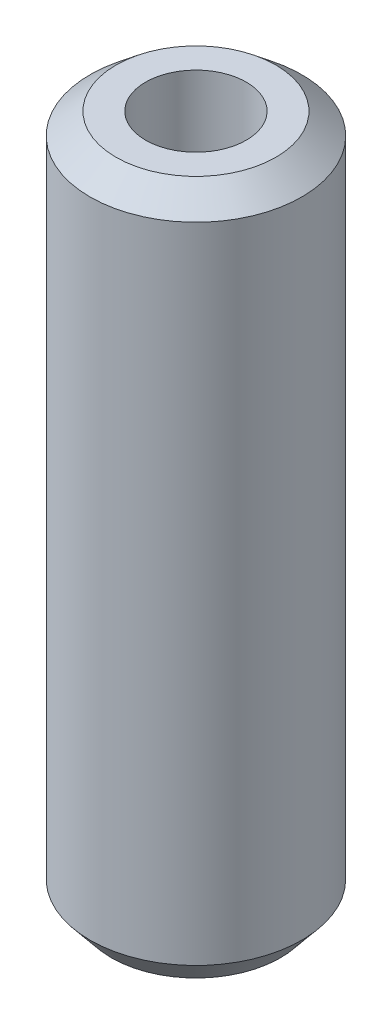
ISO-10303-21;
HEADER;
FILE_DESCRIPTION(('STEP AP214'),'2;1');
FILE_NAME('part.step','',(''),(''),'','','');
FILE_SCHEMA(('AUTOMOTIVE_DESIGN { 1 0 10303 214 1 1 1 1 }'));
ENDSEC;
DATA;
#1=APPLICATION_CONTEXT('core data for automotive mechanical design processes');
#2=APPLICATION_PROTOCOL_DEFINITION('international standard','automotive_design',2000,#1);
#3=PRODUCT_CONTEXT('',#1,'mechanical');
#4=PRODUCT('Part','Part','',(#3));
#5=PRODUCT_RELATED_PRODUCT_CATEGORY('part','',(#4));
#6=PRODUCT_DEFINITION_FORMATION('','',#4);
#7=PRODUCT_DEFINITION_CONTEXT('part definition',#1,'design');
#8=PRODUCT_DEFINITION('design','',#6,#7);
#9=PRODUCT_DEFINITION_SHAPE('','',#8);
#10=(LENGTH_UNIT() NAMED_UNIT(*) SI_UNIT(.MILLI.,.METRE.));
#11=(NAMED_UNIT(*) PLANE_ANGLE_UNIT() SI_UNIT($,.RADIAN.));
#12=(NAMED_UNIT(*) SI_UNIT($,.STERADIAN.) SOLID_ANGLE_UNIT());
#13=UNCERTAINTY_MEASURE_WITH_UNIT(LENGTH_MEASURE(1.E-05),#10,'distance_accuracy_value','');
#14=(GEOMETRIC_REPRESENTATION_CONTEXT(3) GLOBAL_UNCERTAINTY_ASSIGNED_CONTEXT((#13)) GLOBAL_UNIT_ASSIGNED_CONTEXT((#10,
#11,#12)) REPRESENTATION_CONTEXT('',''));
#15=CARTESIAN_POINT('',(0.,0.,0.));
#16=DIRECTION('',(0.,0.,1.));
#17=DIRECTION('',(1.,0.,0.));
#18=AXIS2_PLACEMENT_3D('',#15,#16,#17);
#19=CARTESIAN_POINT('',(0.,146.788859648604,0.));
#20=DIRECTION('',(0.,-1.,0.));
#21=DIRECTION('',(0.,0.,-1.));
#22=AXIS2_PLACEMENT_3D('',#19,#20,#21);
#23=CYLINDRICAL_SURFACE('',#22,22.5);
#24=CARTESIAN_POINT('',(0.,142.253385884476,0.));
#25=DIRECTION('',(0.,1.,0.));
#26=DIRECTION('',(0.,0.,1.));
#27=AXIS2_PLACEMENT_3D('',#24,#25,#26);
#28=CIRCLE('',#27,22.5);
#29=CARTESIAN_POINT('',(0.,142.253385884476,22.5));
#30=VERTEX_POINT('',#29);
#31=EDGE_CURVE('E50',#30,#30,#28,.F.);
#32=ORIENTED_EDGE('',*,*,#31,.T.);
#33=EDGE_LOOP('',(#32));
#34=FACE_BOUND('',#33,.T.);
#35=CARTESIAN_POINT('',(0.,5.51841156021457,0.));
#36=DIRECTION('',(0.,1.,0.));
#37=DIRECTION('',(0.,0.,1.));
#38=AXIS2_PLACEMENT_3D('',#35,#36,#37);
#39=CIRCLE('',#38,22.5);
#40=CARTESIAN_POINT('',(0.,5.51841156021457,22.5));
#41=VERTEX_POINT('',#40);
#42=EDGE_CURVE('E51',#41,#41,#39,.T.);
#43=ORIENTED_EDGE('',*,*,#42,.T.);
#44=EDGE_LOOP('',(#43));
#45=FACE_BOUND('',#44,.T.);
#46=ADVANCED_FACE('F39',(#34,#45),#23,.T.);
#47=CARTESIAN_POINT('',(0.,146.788859648604,0.));
#48=DIRECTION('',(0.,1.,0.));
#49=DIRECTION('',(0.,0.,1.));
#50=AXIS2_PLACEMENT_3D('',#47,#48,#49);
#51=PLANE('',#50);
#52=CARTESIAN_POINT('',(0.,146.788859648604,0.));
#53=DIRECTION('',(0.,1.,0.));
#54=DIRECTION('',(0.,0.,1.));
#55=AXIS2_PLACEMENT_3D('',#52,#53,#54);
#56=CIRCLE('',#55,16.9815884397855);
#57=CARTESIAN_POINT('',(0.,146.788859648604,16.9815884397855));
#58=VERTEX_POINT('',#57);
#59=EDGE_CURVE('E54',#58,#58,#56,.T.);
#60=ORIENTED_EDGE('',*,*,#59,.T.);
#61=EDGE_LOOP('',(#60));
#62=FACE_BOUND('',#61,.T.);
#63=CARTESIAN_POINT('',(0.,146.788859648604,0.));
#64=DIRECTION('',(0.,1.,0.));
#65=DIRECTION('',(0.,0.,1.));
#66=AXIS2_PLACEMENT_3D('',#63,#64,#65);
#67=CIRCLE('',#66,10.6951831914883);
#68=CARTESIAN_POINT('',(0.,146.788859648604,10.6951831914883));
#69=VERTEX_POINT('',#68);
#70=EDGE_CURVE('E58',#69,#69,#67,.T.);
#71=ORIENTED_EDGE('',*,*,#70,.F.);
#72=EDGE_LOOP('',(#71));
#73=FACE_BOUND('',#72,.T.);
#74=ADVANCED_FACE('F69',(#62,#73),#51,.T.);
#75=CARTESIAN_POINT('',(0.,0.,0.));
#76=DIRECTION('',(0.,1.,0.));
#77=DIRECTION('',(0.,0.,1.));
#78=AXIS2_PLACEMENT_3D('',#75,#76,#77);
#79=PLANE('',#78);
#80=CARTESIAN_POINT('',(0.,0.,0.));
#81=DIRECTION('',(0.,1.,0.));
#82=DIRECTION('',(0.,0.,1.));
#83=AXIS2_PLACEMENT_3D('',#80,#81,#82);
#84=CIRCLE('',#83,17.9645262358729);
#85=CARTESIAN_POINT('',(0.,0.,17.9645262358729));
#86=VERTEX_POINT('',#85);
#87=EDGE_CURVE('E10',#86,#86,#84,.F.);
#88=ORIENTED_EDGE('',*,*,#87,.T.);
#89=EDGE_LOOP('',(#88));
#90=FACE_BOUND('',#89,.T.);
#91=CARTESIAN_POINT('',(0.,0.,0.));
#92=DIRECTION('',(0.,1.,0.));
#93=DIRECTION('',(0.,0.,1.));
#94=AXIS2_PLACEMENT_3D('',#91,#92,#93);
#95=CIRCLE('',#94,10.6951831914883);
#96=CARTESIAN_POINT('',(0.,0.,10.6951831914883));
#97=VERTEX_POINT('',#96);
#98=EDGE_CURVE('E63',#97,#97,#95,.T.);
#99=ORIENTED_EDGE('',*,*,#98,.T.);
#100=EDGE_LOOP('',(#99));
#101=FACE_BOUND('',#100,.T.);
#102=ADVANCED_FACE('F75',(#90,#101),#79,.F.);
#103=CARTESIAN_POINT('',(0.,146.788859648604,0.));
#104=DIRECTION('',(0.,-1.,0.));
#105=DIRECTION('',(0.,0.,-1.));
#106=AXIS2_PLACEMENT_3D('',#103,#104,#105);
#107=CYLINDRICAL_SURFACE('',#106,10.6951831914883);
#108=ORIENTED_EDGE('',*,*,#70,.T.);
#109=EDGE_LOOP('',(#108));
#110=FACE_BOUND('',#109,.T.);
#111=ORIENTED_EDGE('',*,*,#98,.F.);
#112=EDGE_LOOP('',(#111));
#113=FACE_BOUND('',#112,.T.);
#114=ADVANCED_FACE('F70',(#110,#113),#107,.F.);
#115=CARTESIAN_POINT('',(0.,146.788859648604,0.));
#116=DIRECTION('',(0.,-1.,0.));
#117=DIRECTION('',(0.,0.,-1.));
#118=AXIS2_PLACEMENT_3D('',#115,#116,#117);
#119=CONICAL_SURFACE('',#118,16.9815884397855,0.88285539905688);
#120=ORIENTED_EDGE('',*,*,#31,.F.);
#121=EDGE_LOOP('',(#120));
#122=FACE_BOUND('',#121,.T.);
#123=ORIENTED_EDGE('',*,*,#59,.F.);
#124=EDGE_LOOP('',(#123));
#125=FACE_BOUND('',#124,.T.);
#126=ADVANCED_FACE('F81',(#122,#125),#119,.T.);
#127=CARTESIAN_POINT('',(0.,5.51841156021457,0.));
#128=DIRECTION('',(0.,1.,0.));
#129=DIRECTION('',(0.,0.,1.));
#130=AXIS2_PLACEMENT_3D('',#127,#128,#129);
#131=CONICAL_SURFACE('',#130,22.5,0.687940927738017);
#132=ORIENTED_EDGE('',*,*,#87,.F.);
#133=EDGE_LOOP('',(#132));
#134=FACE_BOUND('',#133,.T.);
#135=ORIENTED_EDGE('',*,*,#42,.F.);
#136=EDGE_LOOP('',(#135));
#137=FACE_BOUND('',#136,.T.);
#138=ADVANCED_FACE('F45',(#134,#137),#131,.T.);
#139=CLOSED_SHELL('',(#46,#74,#102,#114,#126,#138));
#140=MANIFOLD_SOLID_BREP('B2',#139);
#141=ADVANCED_BREP_SHAPE_REPRESENTATION('',(#18,#140),#14);
#142=SHAPE_DEFINITION_REPRESENTATION(#9,#141);
ENDSEC;
END-ISO-10303-21;
